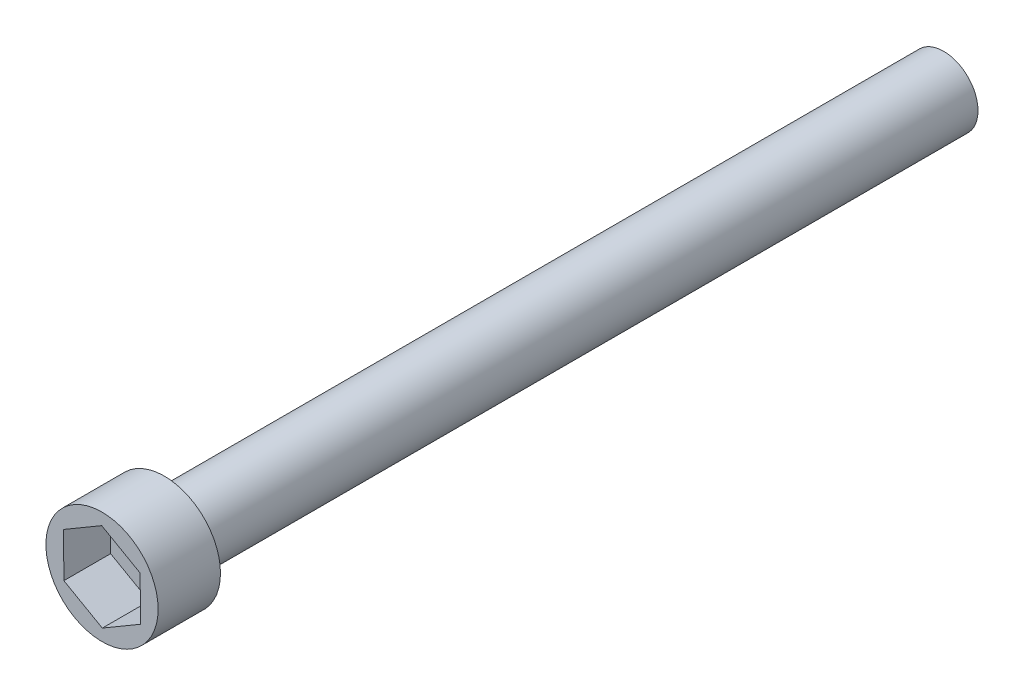
ISO-10303-21;
HEADER;
FILE_DESCRIPTION(('STEP AP214'),'2;1');
FILE_NAME('part.step','',(''),(''),'','','');
FILE_SCHEMA(('AUTOMOTIVE_DESIGN { 1 0 10303 214 1 1 1 1 }'));
ENDSEC;
DATA;
#1=APPLICATION_CONTEXT('core data for automotive mechanical design processes');
#2=APPLICATION_PROTOCOL_DEFINITION('international standard','automotive_design',2000,#1);
#3=PRODUCT_CONTEXT('',#1,'mechanical');
#4=PRODUCT('Part','Part','',(#3));
#5=PRODUCT_RELATED_PRODUCT_CATEGORY('part','',(#4));
#6=PRODUCT_DEFINITION_FORMATION('','',#4);
#7=PRODUCT_DEFINITION_CONTEXT('part definition',#1,'design');
#8=PRODUCT_DEFINITION('design','',#6,#7);
#9=PRODUCT_DEFINITION_SHAPE('','',#8);
#10=(LENGTH_UNIT() NAMED_UNIT(*) SI_UNIT(.MILLI.,.METRE.));
#11=(NAMED_UNIT(*) PLANE_ANGLE_UNIT() SI_UNIT($,.RADIAN.));
#12=(NAMED_UNIT(*) SI_UNIT($,.STERADIAN.) SOLID_ANGLE_UNIT());
#13=UNCERTAINTY_MEASURE_WITH_UNIT(LENGTH_MEASURE(1.E-05),#10,'distance_accuracy_value','');
#14=(GEOMETRIC_REPRESENTATION_CONTEXT(3) GLOBAL_UNCERTAINTY_ASSIGNED_CONTEXT((#13)) GLOBAL_UNIT_ASSIGNED_CONTEXT((#10,
#11,#12)) REPRESENTATION_CONTEXT('',''));
#15=CARTESIAN_POINT('',(0.,0.,0.));
#16=DIRECTION('',(0.,0.,1.));
#17=DIRECTION('',(1.,0.,0.));
#18=AXIS2_PLACEMENT_3D('',#15,#16,#17);
#19=CARTESIAN_POINT('',(0.,0.,31.75));
#20=DIRECTION('',(0.,0.,-1.));
#21=DIRECTION('',(-1.,0.,0.));
#22=AXIS2_PLACEMENT_3D('',#19,#20,#21);
#23=CYLINDRICAL_SURFACE('',#22,1.397);
#24=CARTESIAN_POINT('',(0.,0.,31.75));
#25=DIRECTION('',(0.,0.,1.));
#26=DIRECTION('',(1.,0.,0.));
#27=AXIS2_PLACEMENT_3D('',#24,#25,#26);
#28=CIRCLE('',#27,1.397);
#29=CARTESIAN_POINT('',(1.397,0.,31.75));
#30=VERTEX_POINT('',#29);
#31=EDGE_CURVE('E11',#30,#30,#28,.T.);
#32=ORIENTED_EDGE('',*,*,#31,.F.);
#33=EDGE_LOOP('',(#32));
#34=FACE_BOUND('',#33,.T.);
#35=CARTESIAN_POINT('',(0.,0.,0.));
#36=DIRECTION('',(0.,0.,1.));
#37=DIRECTION('',(1.,0.,0.));
#38=AXIS2_PLACEMENT_3D('',#35,#36,#37);
#39=CIRCLE('',#38,1.397);
#40=CARTESIAN_POINT('',(1.397,0.,0.));
#41=VERTEX_POINT('',#40);
#42=EDGE_CURVE('E35',#41,#41,#39,.T.);
#43=ORIENTED_EDGE('',*,*,#42,.T.);
#44=EDGE_LOOP('',(#43));
#45=FACE_BOUND('',#44,.T.);
#46=ADVANCED_FACE('F32',(#34,#45),#23,.T.);
#47=CARTESIAN_POINT('',(0.,0.,0.));
#48=DIRECTION('',(0.,0.,1.));
#49=DIRECTION('',(1.,0.,0.));
#50=AXIS2_PLACEMENT_3D('',#47,#48,#49);
#51=PLANE('',#50);
#52=ORIENTED_EDGE('',*,*,#42,.F.);
#53=EDGE_LOOP('',(#52));
#54=FACE_BOUND('',#53,.T.);
#55=ADVANCED_FACE('F163',(#54),#51,.F.);
#56=CARTESIAN_POINT('',(0.,0.,34.29));
#57=DIRECTION('',(0.,0.,-1.));
#58=DIRECTION('',(-1.,0.,0.));
#59=AXIS2_PLACEMENT_3D('',#56,#57,#58);
#60=CYLINDRICAL_SURFACE('',#59,2.286);
#61=CARTESIAN_POINT('',(0.,0.,34.29));
#62=DIRECTION('',(0.,0.,1.));
#63=DIRECTION('',(1.,0.,0.));
#64=AXIS2_PLACEMENT_3D('',#61,#62,#63);
#65=CIRCLE('',#64,2.286);
#66=CARTESIAN_POINT('',(2.286,0.,34.29));
#67=VERTEX_POINT('',#66);
#68=EDGE_CURVE('E139',#67,#67,#65,.T.);
#69=ORIENTED_EDGE('',*,*,#68,.F.);
#70=EDGE_LOOP('',(#69));
#71=FACE_BOUND('',#70,.T.);
#72=CARTESIAN_POINT('',(0.,0.,31.75));
#73=DIRECTION('',(0.,0.,1.));
#74=DIRECTION('',(1.,0.,0.));
#75=AXIS2_PLACEMENT_3D('',#72,#73,#74);
#76=CIRCLE('',#75,2.286);
#77=CARTESIAN_POINT('',(2.286,0.,31.75));
#78=VERTEX_POINT('',#77);
#79=EDGE_CURVE('E133',#78,#78,#76,.T.);
#80=ORIENTED_EDGE('',*,*,#79,.T.);
#81=EDGE_LOOP('',(#80));
#82=FACE_BOUND('',#81,.T.);
#83=ADVANCED_FACE('F145',(#71,#82),#60,.T.);
#84=CARTESIAN_POINT('',(0.,0.,34.29));
#85=DIRECTION('',(0.,0.,1.));
#86=DIRECTION('',(1.,0.,0.));
#87=AXIS2_PLACEMENT_3D('',#84,#85,#86);
#88=PLANE('',#87);
#89=DIRECTION('',(0.862531346368491,0.506003632923479,0.));
#90=VECTOR('',#89,1.);
#91=CARTESIAN_POINT('',(0.0125142026998675,-1.80151325714393,34.29));
#92=LINE('',#91,#90);
#93=CARTESIAN_POINT('',(0.0125142026998675,-1.80151325714393,34.29));
#94=VERTEX_POINT('',#93);
#95=CARTESIAN_POINT('',(1.56641334729102,-0.889919011125769,34.29));
#96=VERTEX_POINT('',#95);
#97=EDGE_CURVE('E46',#94,#96,#92,.T.);
#98=ORIENTED_EDGE('',*,*,#97,.F.);
#99=DIRECTION('',(0.869477673703194,-0.493972241053768,0.));
#100=VECTOR('',#99,1.);
#101=CARTESIAN_POINT('',(-1.55389914459116,-0.911594246018158,34.29));
#102=LINE('',#101,#100);
#103=CARTESIAN_POINT('',(-1.55389914459116,-0.911594246018158,34.29));
#104=VERTEX_POINT('',#103);
#105=EDGE_CURVE('E129',#104,#94,#102,.T.);
#106=ORIENTED_EDGE('',*,*,#105,.F.);
#107=DIRECTION('',(0.00694632733470342,-0.999975873977247,0.));
#108=VECTOR('',#107,1.);
#109=CARTESIAN_POINT('',(-1.56641334729102,0.889919011125771,34.29));
#110=LINE('',#109,#108);
#111=CARTESIAN_POINT('',(-1.56641334729102,0.889919011125771,34.29));
#112=VERTEX_POINT('',#111);
#113=EDGE_CURVE('E127',#112,#104,#110,.T.);
#114=ORIENTED_EDGE('',*,*,#113,.F.);
#115=DIRECTION('',(-0.862531346368491,-0.506003632923479,0.));
#116=VECTOR('',#115,1.);
#117=CARTESIAN_POINT('',(-0.0125142026998681,1.80151325714393,34.29));
#118=LINE('',#117,#116);
#119=CARTESIAN_POINT('',(-0.0125142026998681,1.80151325714393,34.29));
#120=VERTEX_POINT('',#119);
#121=EDGE_CURVE('E94',#120,#112,#118,.T.);
#122=ORIENTED_EDGE('',*,*,#121,.F.);
#123=DIRECTION('',(-0.869477673703194,0.493972241053768,0.));
#124=VECTOR('',#123,1.);
#125=CARTESIAN_POINT('',(1.55389914459116,0.911594246018159,34.29));
#126=LINE('',#125,#124);
#127=CARTESIAN_POINT('',(1.55389914459116,0.911594246018159,34.29));
#128=VERTEX_POINT('',#127);
#129=EDGE_CURVE('E123',#128,#120,#126,.T.);
#130=ORIENTED_EDGE('',*,*,#129,.F.);
#131=DIRECTION('',(-0.00694632733470354,0.999975873977247,0.));
#132=VECTOR('',#131,1.);
#133=CARTESIAN_POINT('',(1.56641334729102,-0.889919011125769,34.29));
#134=LINE('',#133,#132);
#135=EDGE_CURVE('E120',#96,#128,#134,.T.);
#136=ORIENTED_EDGE('',*,*,#135,.F.);
#137=EDGE_LOOP('',(#98,#106,#114,#122,#130,#136));
#138=FACE_BOUND('',#137,.T.);
#139=ORIENTED_EDGE('',*,*,#68,.T.);
#140=EDGE_LOOP('',(#139));
#141=FACE_BOUND('',#140,.T.);
#142=ADVANCED_FACE('F150',(#138,#141),#88,.T.);
#143=CARTESIAN_POINT('',(0.,0.,31.75));
#144=DIRECTION('',(0.,0.,1.));
#145=DIRECTION('',(1.,0.,0.));
#146=AXIS2_PLACEMENT_3D('',#143,#144,#145);
#147=PLANE('',#146);
#148=ORIENTED_EDGE('',*,*,#31,.T.);
#149=EDGE_LOOP('',(#148));
#150=FACE_BOUND('',#149,.T.);
#151=ORIENTED_EDGE('',*,*,#79,.F.);
#152=EDGE_LOOP('',(#151));
#153=FACE_BOUND('',#152,.T.);
#154=ADVANCED_FACE('F147',(#150,#153),#147,.F.);
#155=CARTESIAN_POINT('',(0.0125142026998675,-1.80151325714393,32.385));
#156=DIRECTION('',(0.506003632923479,-0.86253134636849,0.));
#157=DIRECTION('',(0.86253134636849,0.506003632923479,0.));
#158=AXIS2_PLACEMENT_3D('',#155,#156,#157);
#159=PLANE('',#158);
#160=ORIENTED_EDGE('',*,*,#97,.T.);
#161=DIRECTION('',(0.,0.,1.));
#162=VECTOR('',#161,1.);
#163=CARTESIAN_POINT('',(1.56641334729102,-0.889919011125769,32.385));
#164=LINE('',#163,#162);
#165=CARTESIAN_POINT('',(1.56641334729102,-0.889919011125769,32.385));
#166=VERTEX_POINT('',#165);
#167=EDGE_CURVE('E76',#166,#96,#164,.T.);
#168=ORIENTED_EDGE('',*,*,#167,.F.);
#169=DIRECTION('',(0.862531346368491,0.506003632923479,0.));
#170=VECTOR('',#169,1.);
#171=CARTESIAN_POINT('',(0.0125142026998675,-1.80151325714393,32.385));
#172=LINE('',#171,#170);
#173=CARTESIAN_POINT('',(0.0125142026998675,-1.80151325714393,32.385));
#174=VERTEX_POINT('',#173);
#175=EDGE_CURVE('E131',#174,#166,#172,.T.);
#176=ORIENTED_EDGE('',*,*,#175,.F.);
#177=DIRECTION('',(0.,0.,1.));
#178=VECTOR('',#177,1.);
#179=CARTESIAN_POINT('',(0.0125142026998675,-1.80151325714393,32.385));
#180=LINE('',#179,#178);
#181=EDGE_CURVE('E54',#174,#94,#180,.T.);
#182=ORIENTED_EDGE('',*,*,#181,.T.);
#183=EDGE_LOOP('',(#160,#168,#176,#182));
#184=FACE_BOUND('',#183,.T.);
#185=ADVANCED_FACE('F149',(#184),#159,.F.);
#186=CARTESIAN_POINT('',(-1.55389914459116,-0.911594246018158,32.385));
#187=DIRECTION('',(-0.493972241053768,-0.869477673703194,0.));
#188=DIRECTION('',(0.869477673703194,-0.493972241053768,0.));
#189=AXIS2_PLACEMENT_3D('',#186,#187,#188);
#190=PLANE('',#189);
#191=ORIENTED_EDGE('',*,*,#105,.T.);
#192=ORIENTED_EDGE('',*,*,#181,.F.);
#193=DIRECTION('',(0.869477673703194,-0.493972241053768,0.));
#194=VECTOR('',#193,1.);
#195=CARTESIAN_POINT('',(-1.55389914459116,-0.911594246018158,32.385));
#196=LINE('',#195,#194);
#197=CARTESIAN_POINT('',(-1.55389914459116,-0.911594246018158,32.385));
#198=VERTEX_POINT('',#197);
#199=EDGE_CURVE('E106',#198,#174,#196,.T.);
#200=ORIENTED_EDGE('',*,*,#199,.F.);
#201=DIRECTION('',(0.,0.,1.));
#202=VECTOR('',#201,1.);
#203=CARTESIAN_POINT('',(-1.55389914459116,-0.911594246018158,32.385));
#204=LINE('',#203,#202);
#205=EDGE_CURVE('E98',#198,#104,#204,.T.);
#206=ORIENTED_EDGE('',*,*,#205,.T.);
#207=EDGE_LOOP('',(#191,#192,#200,#206));
#208=FACE_BOUND('',#207,.T.);
#209=ADVANCED_FACE('F157',(#208),#190,.F.);
#210=CARTESIAN_POINT('',(-1.56641334729102,0.889919011125771,32.385));
#211=DIRECTION('',(-0.999975873977247,-0.00694632733470342,0.));
#212=DIRECTION('',(0.00694632733470342,-0.999975873977247,0.));
#213=AXIS2_PLACEMENT_3D('',#210,#211,#212);
#214=PLANE('',#213);
#215=ORIENTED_EDGE('',*,*,#113,.T.);
#216=ORIENTED_EDGE('',*,*,#205,.F.);
#217=DIRECTION('',(0.00694632733470342,-0.999975873977247,0.));
#218=VECTOR('',#217,1.);
#219=CARTESIAN_POINT('',(-1.56641334729102,0.889919011125771,32.385));
#220=LINE('',#219,#218);
#221=CARTESIAN_POINT('',(-1.56641334729102,0.889919011125771,32.385));
#222=VERTEX_POINT('',#221);
#223=EDGE_CURVE('E102',#222,#198,#220,.T.);
#224=ORIENTED_EDGE('',*,*,#223,.F.);
#225=DIRECTION('',(0.,0.,1.));
#226=VECTOR('',#225,1.);
#227=CARTESIAN_POINT('',(-1.56641334729102,0.889919011125771,32.385));
#228=LINE('',#227,#226);
#229=EDGE_CURVE('E87',#222,#112,#228,.T.);
#230=ORIENTED_EDGE('',*,*,#229,.T.);
#231=EDGE_LOOP('',(#215,#216,#224,#230));
#232=FACE_BOUND('',#231,.T.);
#233=ADVANCED_FACE('F103',(#232),#214,.F.);
#234=CARTESIAN_POINT('',(-0.0125142026998681,1.80151325714393,32.385));
#235=DIRECTION('',(-0.506003632923479,0.862531346368491,0.));
#236=DIRECTION('',(-0.862531346368491,-0.506003632923479,0.));
#237=AXIS2_PLACEMENT_3D('',#234,#235,#236);
#238=PLANE('',#237);
#239=ORIENTED_EDGE('',*,*,#121,.T.);
#240=ORIENTED_EDGE('',*,*,#229,.F.);
#241=DIRECTION('',(-0.862531346368491,-0.506003632923479,0.));
#242=VECTOR('',#241,1.);
#243=CARTESIAN_POINT('',(-0.0125142026998681,1.80151325714393,32.385));
#244=LINE('',#243,#242);
#245=CARTESIAN_POINT('',(-0.0125142026998681,1.80151325714393,32.385));
#246=VERTEX_POINT('',#245);
#247=EDGE_CURVE('E91',#246,#222,#244,.T.);
#248=ORIENTED_EDGE('',*,*,#247,.F.);
#249=DIRECTION('',(0.,0.,1.));
#250=VECTOR('',#249,1.);
#251=CARTESIAN_POINT('',(-0.0125142026998681,1.80151325714393,32.385));
#252=LINE('',#251,#250);
#253=EDGE_CURVE('E99',#246,#120,#252,.T.);
#254=ORIENTED_EDGE('',*,*,#253,.T.);
#255=EDGE_LOOP('',(#239,#240,#248,#254));
#256=FACE_BOUND('',#255,.T.);
#257=ADVANCED_FACE('F89',(#256),#238,.F.);
#258=CARTESIAN_POINT('',(1.55389914459116,0.911594246018159,32.385));
#259=DIRECTION('',(0.493972241053768,0.869477673703194,0.));
#260=DIRECTION('',(-0.869477673703194,0.493972241053768,0.));
#261=AXIS2_PLACEMENT_3D('',#258,#259,#260);
#262=PLANE('',#261);
#263=ORIENTED_EDGE('',*,*,#129,.T.);
#264=ORIENTED_EDGE('',*,*,#253,.F.);
#265=DIRECTION('',(-0.869477673703194,0.493972241053768,0.));
#266=VECTOR('',#265,1.);
#267=CARTESIAN_POINT('',(1.55389914459116,0.911594246018159,32.385));
#268=LINE('',#267,#266);
#269=CARTESIAN_POINT('',(1.55389914459116,0.911594246018159,32.385));
#270=VERTEX_POINT('',#269);
#271=EDGE_CURVE('E112',#270,#246,#268,.T.);
#272=ORIENTED_EDGE('',*,*,#271,.F.);
#273=DIRECTION('',(0.,0.,1.));
#274=VECTOR('',#273,1.);
#275=CARTESIAN_POINT('',(1.55389914459116,0.911594246018159,32.385));
#276=LINE('',#275,#274);
#277=EDGE_CURVE('E136',#270,#128,#276,.T.);
#278=ORIENTED_EDGE('',*,*,#277,.T.);
#279=EDGE_LOOP('',(#263,#264,#272,#278));
#280=FACE_BOUND('',#279,.T.);
#281=ADVANCED_FACE('F218',(#280),#262,.F.);
#282=CARTESIAN_POINT('',(1.56641334729102,-0.889919011125769,32.385));
#283=DIRECTION('',(0.999975873977247,0.00694632733470354,0.));
#284=DIRECTION('',(-0.00694632733470354,0.999975873977247,0.));
#285=AXIS2_PLACEMENT_3D('',#282,#283,#284);
#286=PLANE('',#285);
#287=ORIENTED_EDGE('',*,*,#135,.T.);
#288=ORIENTED_EDGE('',*,*,#277,.F.);
#289=DIRECTION('',(-0.00694632733470354,0.999975873977247,0.));
#290=VECTOR('',#289,1.);
#291=CARTESIAN_POINT('',(1.56641334729102,-0.889919011125769,32.385));
#292=LINE('',#291,#290);
#293=EDGE_CURVE('E114',#166,#270,#292,.T.);
#294=ORIENTED_EDGE('',*,*,#293,.F.);
#295=ORIENTED_EDGE('',*,*,#167,.T.);
#296=EDGE_LOOP('',(#287,#288,#294,#295));
#297=FACE_BOUND('',#296,.T.);
#298=ADVANCED_FACE('F227',(#297),#286,.F.);
#299=CARTESIAN_POINT('',(0.,0.,32.385));
#300=DIRECTION('',(0.,0.,1.));
#301=DIRECTION('',(1.,0.,0.));
#302=AXIS2_PLACEMENT_3D('',#299,#300,#301);
#303=PLANE('',#302);
#304=ORIENTED_EDGE('',*,*,#175,.T.);
#305=ORIENTED_EDGE('',*,*,#293,.T.);
#306=ORIENTED_EDGE('',*,*,#271,.T.);
#307=ORIENTED_EDGE('',*,*,#247,.T.);
#308=ORIENTED_EDGE('',*,*,#223,.T.);
#309=ORIENTED_EDGE('',*,*,#199,.T.);
#310=EDGE_LOOP('',(#304,#305,#306,#307,#308,#309));
#311=FACE_BOUND('',#310,.T.);
#312=ADVANCED_FACE('F109',(#311),#303,.T.);
#313=CLOSED_SHELL('',(#46,#55,#83,#142,#154,#185,#209,#233,#257,#281,#298,#312));
#314=MANIFOLD_SOLID_BREP('B2',#313);
#315=ADVANCED_BREP_SHAPE_REPRESENTATION('',(#18,#314),#14);
#316=SHAPE_DEFINITION_REPRESENTATION(#9,#315);
ENDSEC;
END-ISO-10303-21;
